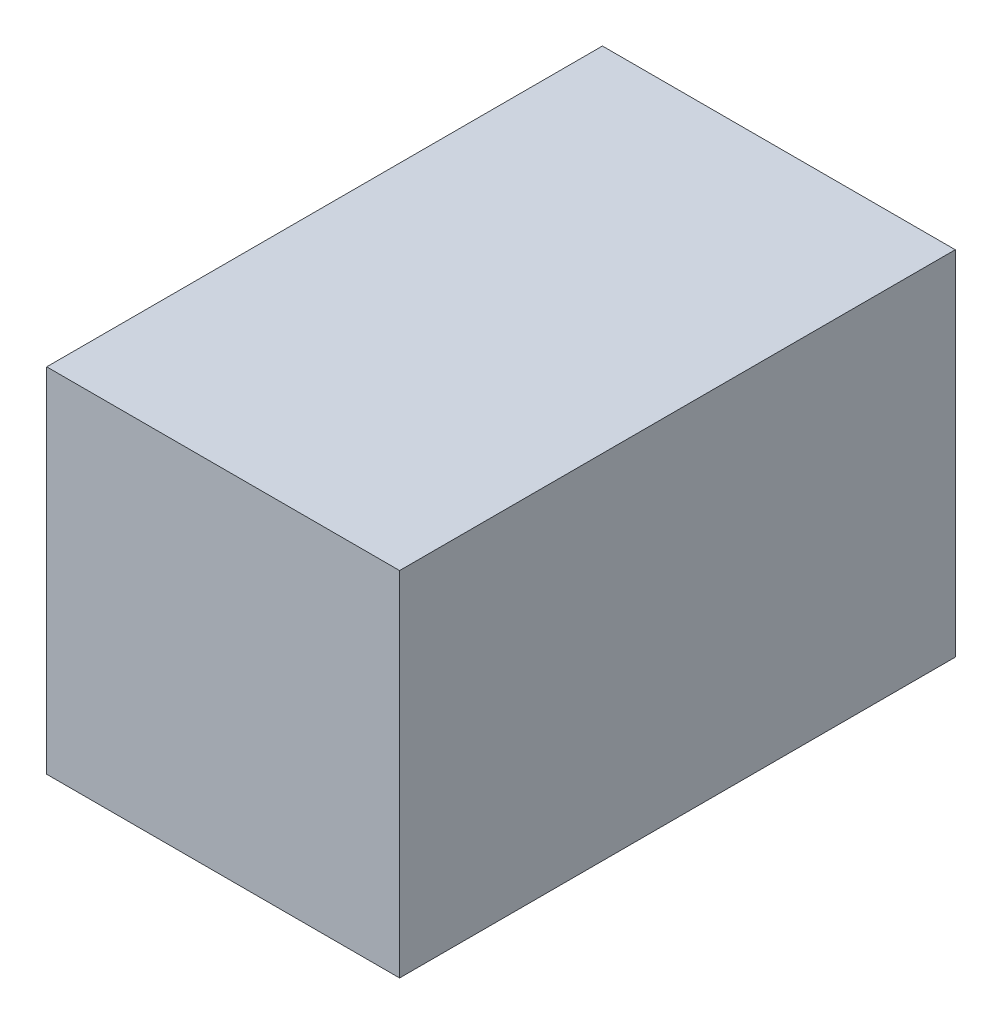
ISO-10303-21;
HEADER;
FILE_DESCRIPTION(('STEP AP214'),'2;1');
FILE_NAME('part.step','',(''),(''),'','','');
FILE_SCHEMA(('AUTOMOTIVE_DESIGN { 1 0 10303 214 1 1 1 1 }'));
ENDSEC;
DATA;
#1=APPLICATION_CONTEXT('core data for automotive mechanical design processes');
#2=APPLICATION_PROTOCOL_DEFINITION('international standard','automotive_design',2000,#1);
#3=PRODUCT_CONTEXT('',#1,'mechanical');
#4=PRODUCT('Part','Part','',(#3));
#5=PRODUCT_RELATED_PRODUCT_CATEGORY('part','',(#4));
#6=PRODUCT_DEFINITION_FORMATION('','',#4);
#7=PRODUCT_DEFINITION_CONTEXT('part definition',#1,'design');
#8=PRODUCT_DEFINITION('design','',#6,#7);
#9=PRODUCT_DEFINITION_SHAPE('','',#8);
#10=(LENGTH_UNIT() NAMED_UNIT(*) SI_UNIT(.MILLI.,.METRE.));
#11=(NAMED_UNIT(*) PLANE_ANGLE_UNIT() SI_UNIT($,.RADIAN.));
#12=(NAMED_UNIT(*) SI_UNIT($,.STERADIAN.) SOLID_ANGLE_UNIT());
#13=UNCERTAINTY_MEASURE_WITH_UNIT(LENGTH_MEASURE(1.E-05),#10,'distance_accuracy_value','');
#14=(GEOMETRIC_REPRESENTATION_CONTEXT(3) GLOBAL_UNCERTAINTY_ASSIGNED_CONTEXT((#13)) GLOBAL_UNIT_ASSIGNED_CONTEXT((#10,
#11,#12)) REPRESENTATION_CONTEXT('',''));
#15=CARTESIAN_POINT('',(0.,0.,0.));
#16=DIRECTION('',(0.,0.,1.));
#17=DIRECTION('',(1.,0.,0.));
#18=AXIS2_PLACEMENT_3D('',#15,#16,#17);
#19=CARTESIAN_POINT('',(22.225,22.225,-35.));
#20=DIRECTION('',(1.,0.,0.));
#21=DIRECTION('',(0.,1.,0.));
#22=AXIS2_PLACEMENT_3D('',#19,#20,#21);
#23=PLANE('',#22);
#24=DIRECTION('',(0.,0.,1.));
#25=VECTOR('',#24,1.);
#26=CARTESIAN_POINT('',(22.225,22.225,-35.));
#27=LINE('',#26,#25);
#28=CARTESIAN_POINT('',(22.225,22.225,-35.));
#29=VERTEX_POINT('',#28);
#30=CARTESIAN_POINT('',(22.225,22.225,35.));
#31=VERTEX_POINT('',#30);
#32=EDGE_CURVE('E46',#29,#31,#27,.T.);
#33=ORIENTED_EDGE('',*,*,#32,.T.);
#34=DIRECTION('',(0.,1.,0.));
#35=VECTOR('',#34,1.);
#36=CARTESIAN_POINT('',(22.225,22.225,35.));
#37=LINE('',#36,#35);
#38=CARTESIAN_POINT('',(22.225,-22.225,35.));
#39=VERTEX_POINT('',#38);
#40=EDGE_CURVE('E84',#39,#31,#37,.T.);
#41=ORIENTED_EDGE('',*,*,#40,.F.);
#42=DIRECTION('',(0.,0.,1.));
#43=VECTOR('',#42,1.);
#44=CARTESIAN_POINT('',(22.225,-22.225,-35.));
#45=LINE('',#44,#43);
#46=CARTESIAN_POINT('',(22.225,-22.225,-35.));
#47=VERTEX_POINT('',#46);
#48=EDGE_CURVE('E11',#47,#39,#45,.T.);
#49=ORIENTED_EDGE('',*,*,#48,.F.);
#50=DIRECTION('',(0.,1.,0.));
#51=VECTOR('',#50,1.);
#52=CARTESIAN_POINT('',(22.225,22.225,-35.));
#53=LINE('',#52,#51);
#54=EDGE_CURVE('E85',#47,#29,#53,.T.);
#55=ORIENTED_EDGE('',*,*,#54,.T.);
#56=EDGE_LOOP('',(#33,#41,#49,#55));
#57=FACE_BOUND('',#56,.T.);
#58=ADVANCED_FACE('F43',(#57),#23,.T.);
#59=CARTESIAN_POINT('',(-22.225,-22.225,-35.));
#60=DIRECTION('',(0.,-1.,0.));
#61=DIRECTION('',(0.,0.,-1.));
#62=AXIS2_PLACEMENT_3D('',#59,#60,#61);
#63=PLANE('',#62);
#64=ORIENTED_EDGE('',*,*,#48,.T.);
#65=DIRECTION('',(1.,0.,0.));
#66=VECTOR('',#65,1.);
#67=CARTESIAN_POINT('',(-22.225,-22.225,35.));
#68=LINE('',#67,#66);
#69=CARTESIAN_POINT('',(-22.225,-22.225,35.));
#70=VERTEX_POINT('',#69);
#71=EDGE_CURVE('E103',#70,#39,#68,.T.);
#72=ORIENTED_EDGE('',*,*,#71,.F.);
#73=DIRECTION('',(0.,0.,1.));
#74=VECTOR('',#73,1.);
#75=CARTESIAN_POINT('',(-22.225,-22.225,-35.));
#76=LINE('',#75,#74);
#77=CARTESIAN_POINT('',(-22.225,-22.225,-35.));
#78=VERTEX_POINT('',#77);
#79=EDGE_CURVE('E52',#78,#70,#76,.T.);
#80=ORIENTED_EDGE('',*,*,#79,.F.);
#81=DIRECTION('',(1.,0.,0.));
#82=VECTOR('',#81,1.);
#83=CARTESIAN_POINT('',(-22.225,-22.225,-35.));
#84=LINE('',#83,#82);
#85=EDGE_CURVE('E91',#78,#47,#84,.T.);
#86=ORIENTED_EDGE('',*,*,#85,.T.);
#87=EDGE_LOOP('',(#64,#72,#80,#86));
#88=FACE_BOUND('',#87,.T.);
#89=ADVANCED_FACE('F127',(#88),#63,.T.);
#90=CARTESIAN_POINT('',(-22.225,22.225,-35.));
#91=DIRECTION('',(-1.,0.,0.));
#92=DIRECTION('',(0.,-1.,0.));
#93=AXIS2_PLACEMENT_3D('',#90,#91,#92);
#94=PLANE('',#93);
#95=ORIENTED_EDGE('',*,*,#79,.T.);
#96=DIRECTION('',(0.,-1.,0.));
#97=VECTOR('',#96,1.);
#98=CARTESIAN_POINT('',(-22.225,22.225,35.));
#99=LINE('',#98,#97);
#100=CARTESIAN_POINT('',(-22.225,22.225,35.));
#101=VERTEX_POINT('',#100);
#102=EDGE_CURVE('E99',#101,#70,#99,.T.);
#103=ORIENTED_EDGE('',*,*,#102,.F.);
#104=DIRECTION('',(0.,0.,1.));
#105=VECTOR('',#104,1.);
#106=CARTESIAN_POINT('',(-22.225,22.225,-35.));
#107=LINE('',#106,#105);
#108=CARTESIAN_POINT('',(-22.225,22.225,-35.));
#109=VERTEX_POINT('',#108);
#110=EDGE_CURVE('E90',#109,#101,#107,.T.);
#111=ORIENTED_EDGE('',*,*,#110,.F.);
#112=DIRECTION('',(0.,-1.,0.));
#113=VECTOR('',#112,1.);
#114=CARTESIAN_POINT('',(-22.225,22.225,-35.));
#115=LINE('',#114,#113);
#116=EDGE_CURVE('E116',#109,#78,#115,.T.);
#117=ORIENTED_EDGE('',*,*,#116,.T.);
#118=EDGE_LOOP('',(#95,#103,#111,#117));
#119=FACE_BOUND('',#118,.T.);
#120=ADVANCED_FACE('F124',(#119),#94,.T.);
#121=CARTESIAN_POINT('',(-22.225,22.225,-35.));
#122=DIRECTION('',(0.,1.,0.));
#123=DIRECTION('',(0.,0.,1.));
#124=AXIS2_PLACEMENT_3D('',#121,#122,#123);
#125=PLANE('',#124);
#126=ORIENTED_EDGE('',*,*,#110,.T.);
#127=DIRECTION('',(-1.,0.,0.));
#128=VECTOR('',#127,1.);
#129=CARTESIAN_POINT('',(-22.225,22.225,35.));
#130=LINE('',#129,#128);
#131=EDGE_CURVE('E93',#31,#101,#130,.T.);
#132=ORIENTED_EDGE('',*,*,#131,.F.);
#133=ORIENTED_EDGE('',*,*,#32,.F.);
#134=DIRECTION('',(-1.,0.,0.));
#135=VECTOR('',#134,1.);
#136=CARTESIAN_POINT('',(-22.225,22.225,-35.));
#137=LINE('',#136,#135);
#138=EDGE_CURVE('E113',#29,#109,#137,.T.);
#139=ORIENTED_EDGE('',*,*,#138,.T.);
#140=EDGE_LOOP('',(#126,#132,#133,#139));
#141=FACE_BOUND('',#140,.T.);
#142=ADVANCED_FACE('F94',(#141),#125,.T.);
#143=CARTESIAN_POINT('',(0.,0.,-35.));
#144=DIRECTION('',(0.,0.,1.));
#145=DIRECTION('',(1.,0.,0.));
#146=AXIS2_PLACEMENT_3D('',#143,#144,#145);
#147=PLANE('',#146);
#148=ORIENTED_EDGE('',*,*,#54,.F.);
#149=ORIENTED_EDGE('',*,*,#85,.F.);
#150=ORIENTED_EDGE('',*,*,#116,.F.);
#151=ORIENTED_EDGE('',*,*,#138,.F.);
#152=EDGE_LOOP('',(#148,#149,#150,#151));
#153=FACE_BOUND('',#152,.T.);
#154=ADVANCED_FACE('F129',(#153),#147,.F.);
#155=CARTESIAN_POINT('',(0.,0.,35.));
#156=DIRECTION('',(0.,0.,1.));
#157=DIRECTION('',(1.,0.,0.));
#158=AXIS2_PLACEMENT_3D('',#155,#156,#157);
#159=PLANE('',#158);
#160=ORIENTED_EDGE('',*,*,#40,.T.);
#161=ORIENTED_EDGE('',*,*,#131,.T.);
#162=ORIENTED_EDGE('',*,*,#102,.T.);
#163=ORIENTED_EDGE('',*,*,#71,.T.);
#164=EDGE_LOOP('',(#160,#161,#162,#163));
#165=FACE_BOUND('',#164,.T.);
#166=ADVANCED_FACE('F102',(#165),#159,.T.);
#167=CLOSED_SHELL('',(#58,#89,#120,#142,#154,#166));
#168=MANIFOLD_SOLID_BREP('B2',#167);
#169=ADVANCED_BREP_SHAPE_REPRESENTATION('',(#18,#168),#14);
#170=SHAPE_DEFINITION_REPRESENTATION(#9,#169);
ENDSEC;
END-ISO-10303-21;
